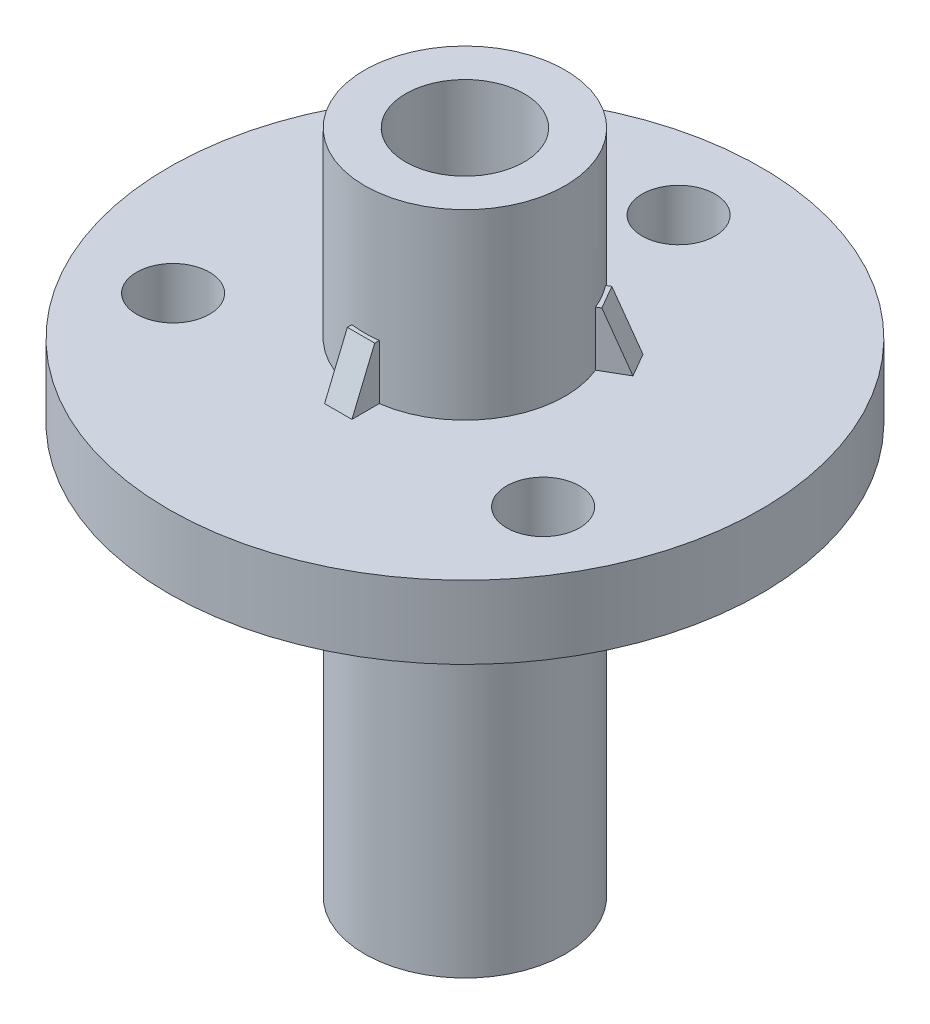
ISO-10303-21;
HEADER;
FILE_DESCRIPTION(('STEP AP214'),'2;1');
FILE_NAME('part.step','',(''),(''),'','','');
FILE_SCHEMA(('AUTOMOTIVE_DESIGN { 1 0 10303 214 1 1 1 1 }'));
ENDSEC;
DATA;
#1=APPLICATION_CONTEXT('core data for automotive mechanical design processes');
#2=APPLICATION_PROTOCOL_DEFINITION('international standard','automotive_design',2000,#1);
#3=PRODUCT_CONTEXT('',#1,'mechanical');
#4=PRODUCT('Part','Part','',(#3));
#5=PRODUCT_RELATED_PRODUCT_CATEGORY('part','',(#4));
#6=PRODUCT_DEFINITION_FORMATION('','',#4);
#7=PRODUCT_DEFINITION_CONTEXT('part definition',#1,'design');
#8=PRODUCT_DEFINITION('design','',#6,#7);
#9=PRODUCT_DEFINITION_SHAPE('','',#8);
#10=(LENGTH_UNIT() NAMED_UNIT(*) SI_UNIT(.MILLI.,.METRE.));
#11=(NAMED_UNIT(*) PLANE_ANGLE_UNIT() SI_UNIT($,.RADIAN.));
#12=(NAMED_UNIT(*) SI_UNIT($,.STERADIAN.) SOLID_ANGLE_UNIT());
#13=UNCERTAINTY_MEASURE_WITH_UNIT(LENGTH_MEASURE(1.E-05),#10,'distance_accuracy_value','');
#14=(GEOMETRIC_REPRESENTATION_CONTEXT(3) GLOBAL_UNCERTAINTY_ASSIGNED_CONTEXT((#13)) GLOBAL_UNIT_ASSIGNED_CONTEXT((#10,
#11,#12)) REPRESENTATION_CONTEXT('',''));
#15=CARTESIAN_POINT('',(0.,0.,0.));
#16=DIRECTION('',(0.,0.,1.));
#17=DIRECTION('',(1.,0.,0.));
#18=AXIS2_PLACEMENT_3D('',#15,#16,#17);
#19=CARTESIAN_POINT('',(0.,-2.032,0.));
#20=DIRECTION('',(0.,1.,0.));
#21=DIRECTION('',(0.,0.,1.));
#22=AXIS2_PLACEMENT_3D('',#19,#20,#21);
#23=PLANE('',#22);
#24=CARTESIAN_POINT('',(10.3111149638085,-2.032,5.9531249999999));
#25=DIRECTION('',(0.,1.,0.));
#26=DIRECTION('',(0.,0.,1.));
#27=AXIS2_PLACEMENT_3D('',#24,#25,#26);
#28=CIRCLE('',#27,2.032);
#29=CARTESIAN_POINT('',(10.3111149638085,-2.032,7.98512499999991));
#30=VERTEX_POINT('',#29);
#31=EDGE_CURVE('E726',#30,#30,#28,.T.);
#32=ORIENTED_EDGE('',*,*,#31,.T.);
#33=EDGE_LOOP('',(#32));
#34=FACE_BOUND('',#33,.T.);
#35=CARTESIAN_POINT('',(-10.3111149638084,-2.032,5.95312500000005));
#36=DIRECTION('',(0.,1.,0.));
#37=DIRECTION('',(0.,0.,1.));
#38=AXIS2_PLACEMENT_3D('',#35,#36,#37);
#39=CIRCLE('',#38,2.032);
#40=CARTESIAN_POINT('',(-10.3111149638084,-2.032,7.98512500000005));
#41=VERTEX_POINT('',#40);
#42=EDGE_CURVE('E730',#41,#41,#39,.T.);
#43=ORIENTED_EDGE('',*,*,#42,.T.);
#44=EDGE_LOOP('',(#43));
#45=FACE_BOUND('',#44,.T.);
#46=CARTESIAN_POINT('',(0.,-2.032,-11.90625));
#47=DIRECTION('',(0.,1.,0.));
#48=DIRECTION('',(0.,0.,1.));
#49=AXIS2_PLACEMENT_3D('',#46,#47,#48);
#50=CIRCLE('',#49,2.032);
#51=CARTESIAN_POINT('',(0.,-2.032,-9.87425));
#52=VERTEX_POINT('',#51);
#53=EDGE_CURVE('E228',#52,#52,#50,.T.);
#54=ORIENTED_EDGE('',*,*,#53,.T.);
#55=EDGE_LOOP('',(#54));
#56=FACE_BOUND('',#55,.T.);
#57=CARTESIAN_POINT('',(0.,-2.032,0.));
#58=DIRECTION('',(0.,1.,0.));
#59=DIRECTION('',(0.,0.,1.));
#60=AXIS2_PLACEMENT_3D('',#57,#58,#59);
#61=CIRCLE('',#60,16.51);
#62=CARTESIAN_POINT('',(0.,-2.032,16.51));
#63=VERTEX_POINT('',#62);
#64=EDGE_CURVE('E314',#63,#63,#61,.T.);
#65=ORIENTED_EDGE('',*,*,#64,.F.);
#66=EDGE_LOOP('',(#65));
#67=FACE_BOUND('',#66,.T.);
#68=DIRECTION('',(0.866025403784443,0.,-0.499999999999993));
#69=VECTOR('',#68,1.);
#70=CARTESIAN_POINT('',(-0.380999999999991,-2.032,-0.659911357683739));
#71=LINE('',#70,#69);
#72=CARTESIAN_POINT('',(4.41314486639696,-2.032,-3.42781218683203));
#73=VERTEX_POINT('',#72);
#74=CARTESIAN_POINT('',(5.73296758176445,-2.032,-4.18981218683202));
#75=VERTEX_POINT('',#74);
#76=EDGE_CURVE('E239',#73,#75,#71,.T.);
#77=ORIENTED_EDGE('',*,*,#76,.F.);
#78=CARTESIAN_POINT('',(0.,-2.032,0.));
#79=DIRECTION('',(0.,1.,0.));
#80=DIRECTION('',(0.,0.,1.));
#81=AXIS2_PLACEMENT_3D('',#78,#79,#80);
#82=CIRCLE('',#81,5.588);
#83=CARTESIAN_POINT('',(-4.41314486639691,-2.032,-3.42781218683209));
#84=VERTEX_POINT('',#83);
#85=EDGE_CURVE('E327',#84,#73,#82,.F.);
#86=ORIENTED_EDGE('',*,*,#85,.F.);
#87=DIRECTION('',(0.866025403784437,0.,0.500000000000003));
#88=VECTOR('',#87,1.);
#89=CARTESIAN_POINT('',(0.381000000000006,-2.032,-0.659911357683747));
#90=LINE('',#89,#88);
#91=CARTESIAN_POINT('',(-5.73296758176439,-2.032,-4.1898121868321));
#92=VERTEX_POINT('',#91);
#93=EDGE_CURVE('E263',#92,#84,#90,.T.);
#94=ORIENTED_EDGE('',*,*,#93,.F.);
#95=DIRECTION('',(0.500000000000004,0.,-0.866025403784436));
#96=VECTOR('',#95,1.);
#97=CARTESIAN_POINT('',(-6.1139675817644,-2.032,-3.52990082914836));
#98=LINE('',#97,#96);
#99=CARTESIAN_POINT('',(-6.4949675817644,-2.032,-2.86998947146462));
#100=VERTEX_POINT('',#99);
#101=EDGE_CURVE('E271',#100,#92,#98,.T.);
#102=ORIENTED_EDGE('',*,*,#101,.F.);
#103=DIRECTION('',(-0.866025403784437,0.,-0.500000000000003));
#104=VECTOR('',#103,1.);
#105=CARTESIAN_POINT('',(-0.380999999999999,-2.032,0.659911357683735));
#106=LINE('',#105,#104);
#107=CARTESIAN_POINT('',(-5.17514486639692,-2.032,-2.10798947146461));
#108=VERTEX_POINT('',#107);
#109=EDGE_CURVE('E268',#108,#100,#106,.T.);
#110=ORIENTED_EDGE('',*,*,#109,.F.);
#111=CARTESIAN_POINT('',(-0.762000000000001,-2.032,5.53580165829666));
#112=VERTEX_POINT('',#111);
#113=EDGE_CURVE('E323',#112,#108,#82,.F.);
#114=ORIENTED_EDGE('',*,*,#113,.F.);
#115=DIRECTION('',(0.,0.,-1.));
#116=VECTOR('',#115,1.);
#117=CARTESIAN_POINT('',(-0.762000000000007,-2.032,0.));
#118=LINE('',#117,#116);
#119=CARTESIAN_POINT('',(-0.761999999999999,-2.032,7.05980165829666));
#120=VERTEX_POINT('',#119);
#121=EDGE_CURVE('E291',#120,#112,#118,.T.);
#122=ORIENTED_EDGE('',*,*,#121,.F.);
#123=DIRECTION('',(-1.,0.,0.));
#124=VECTOR('',#123,1.);
#125=CARTESIAN_POINT('',(0.,-2.032,7.05980165829666));
#126=LINE('',#125,#124);
#127=CARTESIAN_POINT('',(0.762000000000001,-2.032,7.05980165829666));
#128=VERTEX_POINT('',#127);
#129=EDGE_CURVE('E298',#128,#120,#126,.T.);
#130=ORIENTED_EDGE('',*,*,#129,.F.);
#131=DIRECTION('',(0.,0.,1.));
#132=VECTOR('',#131,1.);
#133=CARTESIAN_POINT('',(0.761999999999993,-2.032,0.));
#134=LINE('',#133,#132);
#135=CARTESIAN_POINT('',(0.761999999999999,-2.032,5.53580165829666));
#136=VERTEX_POINT('',#135);
#137=EDGE_CURVE('E296',#136,#128,#134,.T.);
#138=ORIENTED_EDGE('',*,*,#137,.F.);
#139=CARTESIAN_POINT('',(5.17514486639695,-2.032,-2.10798947146454));
#140=VERTEX_POINT('',#139);
#141=EDGE_CURVE('E320',#140,#136,#82,.F.);
#142=ORIENTED_EDGE('',*,*,#141,.F.);
#143=DIRECTION('',(-0.866025403784443,0.,0.499999999999993));
#144=VECTOR('',#143,1.);
#145=CARTESIAN_POINT('',(0.380999999999998,-2.032,0.659911357683751));
#146=LINE('',#145,#144);
#147=CARTESIAN_POINT('',(6.49496758176444,-2.032,-2.86998947146453));
#148=VERTEX_POINT('',#147);
#149=EDGE_CURVE('E234',#148,#140,#146,.T.);
#150=ORIENTED_EDGE('',*,*,#149,.F.);
#151=DIRECTION('',(0.499999999999992,0.,0.866025403784443));
#152=VECTOR('',#151,1.);
#153=CARTESIAN_POINT('',(6.11396758176444,-2.032,-3.52990082914827));
#154=LINE('',#153,#152);
#155=EDGE_CURVE('E242',#75,#148,#154,.T.);
#156=ORIENTED_EDGE('',*,*,#155,.F.);
#157=EDGE_LOOP('',(#77,#86,#94,#102,#110,#114,#122,#130,#138,#142,#150,#156));
#158=FACE_BOUND('',#157,.T.);
#159=ADVANCED_FACE('F35',(#34,#45,#56,#67,#158),#23,.F.);
#160=CARTESIAN_POINT('',(0.,2.032,0.));
#161=DIRECTION('',(0.,1.,0.));
#162=DIRECTION('',(0.,0.,1.));
#163=AXIS2_PLACEMENT_3D('',#160,#161,#162);
#164=PLANE('',#163);
#165=CARTESIAN_POINT('',(10.3111149638085,2.032,5.9531249999999));
#166=DIRECTION('',(0.,1.,0.));
#167=DIRECTION('',(-0.866025403784443,0.,-0.499999999999992));
#168=AXIS2_PLACEMENT_3D('',#165,#166,#167);
#169=CIRCLE('',#168,2.032);
#170=CARTESIAN_POINT('',(8.55135134331854,2.032,4.93712499999992));
#171=VERTEX_POINT('',#170);
#172=EDGE_CURVE('E724',#171,#171,#169,.T.);
#173=ORIENTED_EDGE('',*,*,#172,.F.);
#174=EDGE_LOOP('',(#173));
#175=FACE_BOUND('',#174,.T.);
#176=CARTESIAN_POINT('',(-10.3111149638084,2.032,5.95312500000005));
#177=DIRECTION('',(0.,1.,0.));
#178=DIRECTION('',(0.866025403784436,0.,-0.500000000000004));
#179=AXIS2_PLACEMENT_3D('',#176,#177,#178);
#180=CIRCLE('',#179,2.032);
#181=CARTESIAN_POINT('',(-8.55135134331847,2.032,4.93712500000004));
#182=VERTEX_POINT('',#181);
#183=EDGE_CURVE('E727',#182,#182,#180,.T.);
#184=ORIENTED_EDGE('',*,*,#183,.F.);
#185=EDGE_LOOP('',(#184));
#186=FACE_BOUND('',#185,.T.);
#187=CARTESIAN_POINT('',(0.,2.032,-11.90625));
#188=DIRECTION('',(0.,1.,0.));
#189=DIRECTION('',(0.,0.,1.));
#190=AXIS2_PLACEMENT_3D('',#187,#188,#189);
#191=CIRCLE('',#190,2.032);
#192=CARTESIAN_POINT('',(0.,2.032,-9.87425));
#193=VERTEX_POINT('',#192);
#194=EDGE_CURVE('E736',#193,#193,#191,.T.);
#195=ORIENTED_EDGE('',*,*,#194,.F.);
#196=EDGE_LOOP('',(#195));
#197=FACE_BOUND('',#196,.T.);
#198=CARTESIAN_POINT('',(0.,2.032,0.));
#199=DIRECTION('',(0.,1.,0.));
#200=DIRECTION('',(0.,0.,1.));
#201=AXIS2_PLACEMENT_3D('',#198,#199,#200);
#202=CIRCLE('',#201,16.51);
#203=CARTESIAN_POINT('',(0.,2.032,16.51));
#204=VERTEX_POINT('',#203);
#205=EDGE_CURVE('E317',#204,#204,#202,.T.);
#206=ORIENTED_EDGE('',*,*,#205,.T.);
#207=EDGE_LOOP('',(#206));
#208=FACE_BOUND('',#207,.T.);
#209=CARTESIAN_POINT('',(0.,2.032,0.));
#210=DIRECTION('',(0.,1.,0.));
#211=DIRECTION('',(0.,0.,1.));
#212=AXIS2_PLACEMENT_3D('',#209,#210,#211);
#213=CIRCLE('',#212,5.588);
#214=CARTESIAN_POINT('',(4.41314486639695,2.032,-3.42781218683204));
#215=VERTEX_POINT('',#214);
#216=CARTESIAN_POINT('',(-4.41314486639691,2.032,-3.42781218683209));
#217=VERTEX_POINT('',#216);
#218=EDGE_CURVE('E316',#215,#217,#213,.T.);
#219=ORIENTED_EDGE('',*,*,#218,.F.);
#220=DIRECTION('',(0.866025403784443,0.,-0.499999999999993));
#221=VECTOR('',#220,1.);
#222=CARTESIAN_POINT('',(-0.380999999999991,2.032,-0.659911357683739));
#223=LINE('',#222,#221);
#224=CARTESIAN_POINT('',(5.73296758176445,2.032,-4.18981218683202));
#225=VERTEX_POINT('',#224);
#226=EDGE_CURVE('E236',#215,#225,#223,.T.);
#227=ORIENTED_EDGE('',*,*,#226,.T.);
#228=DIRECTION('',(0.499999999999992,0.,0.866025403784443));
#229=VECTOR('',#228,1.);
#230=CARTESIAN_POINT('',(6.11396758176444,2.032,-3.52990082914827));
#231=LINE('',#230,#229);
#232=CARTESIAN_POINT('',(6.49496758176444,2.032,-2.86998947146453));
#233=VERTEX_POINT('',#232);
#234=EDGE_CURVE('E215',#225,#233,#231,.T.);
#235=ORIENTED_EDGE('',*,*,#234,.T.);
#236=DIRECTION('',(-0.866025403784443,0.,0.499999999999993));
#237=VECTOR('',#236,1.);
#238=CARTESIAN_POINT('',(0.380999999999998,2.032,0.659911357683751));
#239=LINE('',#238,#237);
#240=CARTESIAN_POINT('',(5.17514486639695,2.032,-2.10798947146454));
#241=VERTEX_POINT('',#240);
#242=EDGE_CURVE('E232',#233,#241,#239,.T.);
#243=ORIENTED_EDGE('',*,*,#242,.T.);
#244=CARTESIAN_POINT('',(0.762,2.032,5.53580165829666));
#245=VERTEX_POINT('',#244);
#246=EDGE_CURVE('E201',#245,#241,#213,.T.);
#247=ORIENTED_EDGE('',*,*,#246,.F.);
#248=DIRECTION('',(0.,0.,1.));
#249=VECTOR('',#248,1.);
#250=CARTESIAN_POINT('',(0.761999999999993,2.032,0.));
#251=LINE('',#250,#249);
#252=CARTESIAN_POINT('',(0.762000000000001,2.032,7.05980165829666));
#253=VERTEX_POINT('',#252);
#254=EDGE_CURVE('E293',#245,#253,#251,.T.);
#255=ORIENTED_EDGE('',*,*,#254,.T.);
#256=DIRECTION('',(-1.,0.,0.));
#257=VECTOR('',#256,1.);
#258=CARTESIAN_POINT('',(0.,2.032,7.05980165829666));
#259=LINE('',#258,#257);
#260=CARTESIAN_POINT('',(-0.761999999999999,2.032,7.05980165829666));
#261=VERTEX_POINT('',#260);
#262=EDGE_CURVE('E339',#253,#261,#259,.T.);
#263=ORIENTED_EDGE('',*,*,#262,.T.);
#264=DIRECTION('',(0.,0.,-1.));
#265=VECTOR('',#264,1.);
#266=CARTESIAN_POINT('',(-0.762000000000007,2.032,0.));
#267=LINE('',#266,#265);
#268=CARTESIAN_POINT('',(-0.762000000000001,2.032,5.53580165829666));
#269=VERTEX_POINT('',#268);
#270=EDGE_CURVE('E288',#261,#269,#267,.T.);
#271=ORIENTED_EDGE('',*,*,#270,.T.);
#272=CARTESIAN_POINT('',(-5.17514486639692,2.032,-2.10798947146461));
#273=VERTEX_POINT('',#272);
#274=EDGE_CURVE('E310',#273,#269,#213,.T.);
#275=ORIENTED_EDGE('',*,*,#274,.F.);
#276=DIRECTION('',(-0.866025403784437,0.,-0.500000000000003));
#277=VECTOR('',#276,1.);
#278=CARTESIAN_POINT('',(-0.380999999999999,2.032,0.659911357683735));
#279=LINE('',#278,#277);
#280=CARTESIAN_POINT('',(-6.4949675817644,2.032,-2.86998947146462));
#281=VERTEX_POINT('',#280);
#282=EDGE_CURVE('E265',#273,#281,#279,.T.);
#283=ORIENTED_EDGE('',*,*,#282,.T.);
#284=DIRECTION('',(0.500000000000004,0.,-0.866025403784436));
#285=VECTOR('',#284,1.);
#286=CARTESIAN_POINT('',(-6.1139675817644,2.032,-3.52990082914836));
#287=LINE('',#286,#285);
#288=CARTESIAN_POINT('',(-5.73296758176439,2.032,-4.1898121868321));
#289=VERTEX_POINT('',#288);
#290=EDGE_CURVE('E352',#281,#289,#287,.T.);
#291=ORIENTED_EDGE('',*,*,#290,.T.);
#292=DIRECTION('',(0.866025403784437,0.,0.500000000000003));
#293=VECTOR('',#292,1.);
#294=CARTESIAN_POINT('',(0.381000000000006,2.032,-0.659911357683747));
#295=LINE('',#294,#293);
#296=EDGE_CURVE('E260',#289,#217,#295,.T.);
#297=ORIENTED_EDGE('',*,*,#296,.T.);
#298=EDGE_LOOP('',(#219,#227,#235,#243,#247,#255,#263,#271,#275,#283,#291,#297));
#299=FACE_BOUND('',#298,.T.);
#300=ADVANCED_FACE('F447',(#175,#186,#197,#208,#299),#164,.T.);
#301=CARTESIAN_POINT('',(0.,12.192,0.));
#302=DIRECTION('',(0.,-1.,0.));
#303=DIRECTION('',(0.,0.,-1.));
#304=AXIS2_PLACEMENT_3D('',#301,#302,#303);
#305=CYLINDRICAL_SURFACE('',#304,5.588);
#306=CARTESIAN_POINT('',(0.,12.192,0.));
#307=DIRECTION('',(0.,1.,0.));
#308=DIRECTION('',(0.,0.,1.));
#309=AXIS2_PLACEMENT_3D('',#306,#307,#308);
#310=CIRCLE('',#309,5.588);
#311=CARTESIAN_POINT('',(0.,12.192,5.588));
#312=VERTEX_POINT('',#311);
#313=EDGE_CURVE('E311',#312,#312,#310,.T.);
#314=ORIENTED_EDGE('',*,*,#313,.F.);
#315=EDGE_LOOP('',(#314));
#316=FACE_BOUND('',#315,.T.);
#317=DIRECTION('',(0.,-1.,0.));
#318=VECTOR('',#317,1.);
#319=CARTESIAN_POINT('',(4.41314486639696,5.08,-3.42781218683203));
#320=LINE('',#319,#318);
#321=CARTESIAN_POINT('',(4.41314486639695,5.08,-3.42781218683204));
#322=VERTEX_POINT('',#321);
#323=EDGE_CURVE('E205',#322,#215,#320,.T.);
#324=ORIENTED_EDGE('',*,*,#323,.T.);
#325=ORIENTED_EDGE('',*,*,#218,.T.);
#326=DIRECTION('',(0.,-1.,0.));
#327=VECTOR('',#326,1.);
#328=CARTESIAN_POINT('',(-4.41314486639691,5.08,-3.42781218683209));
#329=LINE('',#328,#327);
#330=CARTESIAN_POINT('',(-4.41314486639691,5.08,-3.42781218683209));
#331=VERTEX_POINT('',#330);
#332=EDGE_CURVE('E252',#331,#217,#329,.T.);
#333=ORIENTED_EDGE('',*,*,#332,.F.);
#334=CARTESIAN_POINT('',(0.,5.08,0.));
#335=DIRECTION('',(0.,-1.,0.));
#336=DIRECTION('',(0.,0.,-1.));
#337=AXIS2_PLACEMENT_3D('',#334,#335,#336);
#338=CIRCLE('',#337,5.588);
#339=CARTESIAN_POINT('',(-5.17514486639691,5.08,-2.10798947146462));
#340=VERTEX_POINT('',#339);
#341=EDGE_CURVE('E349',#340,#331,#338,.T.);
#342=ORIENTED_EDGE('',*,*,#341,.F.);
#343=DIRECTION('',(0.,-1.,0.));
#344=VECTOR('',#343,1.);
#345=CARTESIAN_POINT('',(-5.17514486639692,5.08,-2.10798947146461));
#346=LINE('',#345,#344);
#347=EDGE_CURVE('E258',#340,#273,#346,.T.);
#348=ORIENTED_EDGE('',*,*,#347,.T.);
#349=ORIENTED_EDGE('',*,*,#274,.T.);
#350=DIRECTION('',(0.,-1.,0.));
#351=VECTOR('',#350,1.);
#352=CARTESIAN_POINT('',(-0.762000000000001,5.08,5.53580165829666));
#353=LINE('',#352,#351);
#354=CARTESIAN_POINT('',(-0.762000000000001,5.08,5.53580165829666));
#355=VERTEX_POINT('',#354);
#356=EDGE_CURVE('E281',#355,#269,#353,.T.);
#357=ORIENTED_EDGE('',*,*,#356,.F.);
#358=CARTESIAN_POINT('',(0.,5.08,0.));
#359=DIRECTION('',(0.,-1.,0.));
#360=DIRECTION('',(0.,0.,-1.));
#361=AXIS2_PLACEMENT_3D('',#358,#359,#360);
#362=CIRCLE('',#361,5.588);
#363=CARTESIAN_POINT('',(0.762000000000004,5.08,5.53580165829665));
#364=VERTEX_POINT('',#363);
#365=EDGE_CURVE('E336',#364,#355,#362,.T.);
#366=ORIENTED_EDGE('',*,*,#365,.F.);
#367=DIRECTION('',(0.,-1.,0.));
#368=VECTOR('',#367,1.);
#369=CARTESIAN_POINT('',(0.761999999999999,5.08,5.53580165829666));
#370=LINE('',#369,#368);
#371=EDGE_CURVE('E286',#364,#245,#370,.T.);
#372=ORIENTED_EDGE('',*,*,#371,.T.);
#373=ORIENTED_EDGE('',*,*,#246,.T.);
#374=DIRECTION('',(0.,-1.,0.));
#375=VECTOR('',#374,1.);
#376=CARTESIAN_POINT('',(5.17514486639695,5.08,-2.10798947146454));
#377=LINE('',#376,#375);
#378=CARTESIAN_POINT('',(5.17514486639695,5.08,-2.10798947146454));
#379=VERTEX_POINT('',#378);
#380=EDGE_CURVE('E195',#379,#241,#377,.T.);
#381=ORIENTED_EDGE('',*,*,#380,.F.);
#382=CARTESIAN_POINT('',(0.,5.08,0.));
#383=DIRECTION('',(0.,-1.,0.));
#384=DIRECTION('',(0.,0.,-1.));
#385=AXIS2_PLACEMENT_3D('',#382,#383,#384);
#386=CIRCLE('',#385,5.588);
#387=EDGE_CURVE('E198',#322,#379,#386,.T.);
#388=ORIENTED_EDGE('',*,*,#387,.F.);
#389=EDGE_LOOP('',(#324,#325,#333,#342,#348,#349,#357,#366,#372,#373,#381,#388));
#390=FACE_BOUND('',#389,.T.);
#391=ADVANCED_FACE('F197',(#316,#390),#305,.T.);
#392=CARTESIAN_POINT('',(0.,-24.892,0.));
#393=DIRECTION('',(0.,1.,0.));
#394=DIRECTION('',(0.,0.,1.));
#395=AXIS2_PLACEMENT_3D('',#392,#393,#394);
#396=CYLINDRICAL_SURFACE('',#395,5.588);
#397=CARTESIAN_POINT('',(0.,-24.892,0.));
#398=DIRECTION('',(0.,-1.,0.));
#399=DIRECTION('',(0.,0.,-1.));
#400=AXIS2_PLACEMENT_3D('',#397,#398,#399);
#401=CIRCLE('',#400,5.588);
#402=CARTESIAN_POINT('',(0.,-24.892,-5.588));
#403=VERTEX_POINT('',#402);
#404=EDGE_CURVE('E305',#403,#403,#401,.T.);
#405=ORIENTED_EDGE('',*,*,#404,.F.);
#406=EDGE_LOOP('',(#405));
#407=FACE_BOUND('',#406,.T.);
#408=DIRECTION('',(0.,1.,0.));
#409=VECTOR('',#408,1.);
#410=CARTESIAN_POINT('',(4.41314486639695,-24.892,-3.42781218683204));
#411=LINE('',#410,#409);
#412=CARTESIAN_POINT('',(4.41314486639696,-5.08,-3.42781218683203));
#413=VERTEX_POINT('',#412);
#414=EDGE_CURVE('E216',#413,#73,#411,.T.);
#415=ORIENTED_EDGE('',*,*,#414,.F.);
#416=CARTESIAN_POINT('',(0.,-5.08,0.));
#417=DIRECTION('',(0.,-1.,0.));
#418=DIRECTION('',(0.,0.,-1.));
#419=AXIS2_PLACEMENT_3D('',#416,#417,#418);
#420=CIRCLE('',#419,5.588);
#421=CARTESIAN_POINT('',(5.17514486639695,-5.08,-2.10798947146454));
#422=VERTEX_POINT('',#421);
#423=EDGE_CURVE('E354',#413,#422,#420,.T.);
#424=ORIENTED_EDGE('',*,*,#423,.T.);
#425=DIRECTION('',(0.,1.,0.));
#426=VECTOR('',#425,1.);
#427=CARTESIAN_POINT('',(5.17514486639694,-24.892,-2.10798947146454));
#428=LINE('',#427,#426);
#429=EDGE_CURVE('E357',#140,#422,#428,.F.);
#430=ORIENTED_EDGE('',*,*,#429,.F.);
#431=ORIENTED_EDGE('',*,*,#141,.T.);
#432=DIRECTION('',(0.,1.,0.));
#433=VECTOR('',#432,1.);
#434=CARTESIAN_POINT('',(0.762,-24.892,5.53580165829666));
#435=LINE('',#434,#433);
#436=CARTESIAN_POINT('',(0.761999999999999,-5.08,5.53580165829666));
#437=VERTEX_POINT('',#436);
#438=EDGE_CURVE('E333',#437,#136,#435,.T.);
#439=ORIENTED_EDGE('',*,*,#438,.F.);
#440=CARTESIAN_POINT('',(0.,-5.08,0.));
#441=DIRECTION('',(0.,-1.,0.));
#442=DIRECTION('',(0.,0.,-1.));
#443=AXIS2_PLACEMENT_3D('',#440,#441,#442);
#444=CIRCLE('',#443,5.588);
#445=CARTESIAN_POINT('',(-0.762000000000001,-5.08,5.53580165829666));
#446=VERTEX_POINT('',#445);
#447=EDGE_CURVE('E326',#437,#446,#444,.T.);
#448=ORIENTED_EDGE('',*,*,#447,.T.);
#449=DIRECTION('',(0.,1.,0.));
#450=VECTOR('',#449,1.);
#451=CARTESIAN_POINT('',(-0.762000000000001,-24.892,5.53580165829665));
#452=LINE('',#451,#450);
#453=EDGE_CURVE('E330',#112,#446,#452,.F.);
#454=ORIENTED_EDGE('',*,*,#453,.F.);
#455=ORIENTED_EDGE('',*,*,#113,.T.);
#456=DIRECTION('',(0.,1.,0.));
#457=VECTOR('',#456,1.);
#458=CARTESIAN_POINT('',(-5.17514486639692,-24.892,-2.10798947146461));
#459=LINE('',#458,#457);
#460=CARTESIAN_POINT('',(-5.17514486639692,-5.08,-2.10798947146461));
#461=VERTEX_POINT('',#460);
#462=EDGE_CURVE('E347',#461,#108,#459,.T.);
#463=ORIENTED_EDGE('',*,*,#462,.F.);
#464=CARTESIAN_POINT('',(0.,-5.08,0.));
#465=DIRECTION('',(0.,-1.,0.));
#466=DIRECTION('',(0.,0.,-1.));
#467=AXIS2_PLACEMENT_3D('',#464,#465,#466);
#468=CIRCLE('',#467,5.588);
#469=CARTESIAN_POINT('',(-4.41314486639691,-5.08,-3.42781218683209));
#470=VERTEX_POINT('',#469);
#471=EDGE_CURVE('E341',#461,#470,#468,.T.);
#472=ORIENTED_EDGE('',*,*,#471,.T.);
#473=DIRECTION('',(0.,1.,0.));
#474=VECTOR('',#473,1.);
#475=CARTESIAN_POINT('',(-4.41314486639691,-24.892,-3.42781218683209));
#476=LINE('',#475,#474);
#477=EDGE_CURVE('E344',#84,#470,#476,.F.);
#478=ORIENTED_EDGE('',*,*,#477,.F.);
#479=ORIENTED_EDGE('',*,*,#85,.T.);
#480=EDGE_LOOP('',(#415,#424,#430,#431,#439,#448,#454,#455,#463,#472,#478,#479));
#481=FACE_BOUND('',#480,.T.);
#482=ADVANCED_FACE('F416',(#407,#481),#396,.T.);
#483=CARTESIAN_POINT('',(0.,2.032,0.));
#484=DIRECTION('',(0.,-1.,0.));
#485=DIRECTION('',(0.,0.,-1.));
#486=AXIS2_PLACEMENT_3D('',#483,#484,#485);
#487=CYLINDRICAL_SURFACE('',#486,16.51);
#488=ORIENTED_EDGE('',*,*,#205,.F.);
#489=EDGE_LOOP('',(#488));
#490=FACE_BOUND('',#489,.T.);
#491=ORIENTED_EDGE('',*,*,#64,.T.);
#492=EDGE_LOOP('',(#491));
#493=FACE_BOUND('',#492,.T.);
#494=ADVANCED_FACE('F459',(#490,#493),#487,.T.);
#495=CARTESIAN_POINT('',(0.,12.192,0.));
#496=DIRECTION('',(0.,1.,0.));
#497=DIRECTION('',(0.,0.,1.));
#498=AXIS2_PLACEMENT_3D('',#495,#496,#497);
#499=PLANE('',#498);
#500=CARTESIAN_POINT('',(0.,12.192,0.));
#501=DIRECTION('',(0.,1.,0.));
#502=DIRECTION('',(0.,0.,1.));
#503=AXIS2_PLACEMENT_3D('',#500,#501,#502);
#504=CIRCLE('',#503,3.302);
#505=CARTESIAN_POINT('',(0.,12.192,3.302));
#506=VERTEX_POINT('',#505);
#507=EDGE_CURVE('E301',#506,#506,#504,.T.);
#508=ORIENTED_EDGE('',*,*,#507,.F.);
#509=EDGE_LOOP('',(#508));
#510=FACE_BOUND('',#509,.T.);
#511=ORIENTED_EDGE('',*,*,#313,.T.);
#512=EDGE_LOOP('',(#511));
#513=FACE_BOUND('',#512,.T.);
#514=ADVANCED_FACE('F462',(#510,#513),#499,.T.);
#515=CARTESIAN_POINT('',(0.,-24.892,0.));
#516=DIRECTION('',(0.,-1.,0.));
#517=DIRECTION('',(0.,0.,-1.));
#518=AXIS2_PLACEMENT_3D('',#515,#516,#517);
#519=PLANE('',#518);
#520=CARTESIAN_POINT('',(0.,-24.892,0.));
#521=DIRECTION('',(0.,1.,0.));
#522=DIRECTION('',(0.,0.,1.));
#523=AXIS2_PLACEMENT_3D('',#520,#521,#522);
#524=CIRCLE('',#523,3.302);
#525=CARTESIAN_POINT('',(0.,-24.892,3.302));
#526=VERTEX_POINT('',#525);
#527=EDGE_CURVE('E302',#526,#526,#524,.T.);
#528=ORIENTED_EDGE('',*,*,#527,.T.);
#529=EDGE_LOOP('',(#528));
#530=FACE_BOUND('',#529,.T.);
#531=ORIENTED_EDGE('',*,*,#404,.T.);
#532=EDGE_LOOP('',(#531));
#533=FACE_BOUND('',#532,.T.);
#534=ADVANCED_FACE('F555',(#530,#533),#519,.T.);
#535=CARTESIAN_POINT('',(0.,-24.892,0.));
#536=DIRECTION('',(0.,1.,0.));
#537=DIRECTION('',(0.,0.,1.));
#538=AXIS2_PLACEMENT_3D('',#535,#536,#537);
#539=CYLINDRICAL_SURFACE('',#538,3.302);
#540=ORIENTED_EDGE('',*,*,#527,.F.);
#541=EDGE_LOOP('',(#540));
#542=FACE_BOUND('',#541,.T.);
#543=ORIENTED_EDGE('',*,*,#507,.T.);
#544=EDGE_LOOP('',(#543));
#545=FACE_BOUND('',#544,.T.);
#546=ADVANCED_FACE('F548',(#542,#545),#539,.F.);
#547=CARTESIAN_POINT('',(0.761999999999999,-5.08,5.53580165829666));
#548=DIRECTION('',(0.,-1.,0.));
#549=DIRECTION('',(0.,0.,-1.));
#550=AXIS2_PLACEMENT_3D('',#547,#548,#549);
#551=PLANE('',#550);
#552=DIRECTION('',(0.,0.,-1.));
#553=VECTOR('',#552,1.);
#554=CARTESIAN_POINT('',(0.762000000000001,-5.08,7.05980165829666));
#555=LINE('',#554,#553);
#556=CARTESIAN_POINT('',(0.761999999999999,-5.08,5.78980165829665));
#557=VERTEX_POINT('',#556);
#558=EDGE_CURVE('E274',#557,#437,#555,.T.);
#559=ORIENTED_EDGE('',*,*,#558,.F.);
#560=DIRECTION('',(-1.,0.,0.));
#561=VECTOR('',#560,1.);
#562=CARTESIAN_POINT('',(-0.761999999999999,-5.08,5.78980165829665));
#563=LINE('',#562,#561);
#564=CARTESIAN_POINT('',(-0.762000000000001,-5.08,5.78980165829665));
#565=VERTEX_POINT('',#564);
#566=EDGE_CURVE('E43',#557,#565,#563,.T.);
#567=ORIENTED_EDGE('',*,*,#566,.T.);
#568=DIRECTION('',(0.,0.,1.));
#569=VECTOR('',#568,1.);
#570=CARTESIAN_POINT('',(-0.761999999999999,-5.08,7.05980165829666));
#571=LINE('',#570,#569);
#572=EDGE_CURVE('E278',#446,#565,#571,.T.);
#573=ORIENTED_EDGE('',*,*,#572,.F.);
#574=ORIENTED_EDGE('',*,*,#447,.F.);
#575=EDGE_LOOP('',(#559,#567,#573,#574));
#576=FACE_BOUND('',#575,.T.);
#577=ADVANCED_FACE('F546',(#576),#551,.T.);
#578=CARTESIAN_POINT('',(-0.761999999999999,5.08,7.05980165829666));
#579=DIRECTION('',(1.,0.,0.));
#580=DIRECTION('',(0.,0.,-1.));
#581=AXIS2_PLACEMENT_3D('',#578,#579,#580);
#582=PLANE('',#581);
#583=ORIENTED_EDGE('',*,*,#572,.T.);
#584=DIRECTION('',(0.,0.923076923076924,0.384615384615382));
#585=VECTOR('',#584,1.);
#586=CARTESIAN_POINT('',(-0.761999999999999,-2.03199999999997,7.05980165829666));
#587=LINE('',#586,#585);
#588=EDGE_CURVE('E11',#565,#120,#587,.T.);
#589=ORIENTED_EDGE('',*,*,#588,.T.);
#590=ORIENTED_EDGE('',*,*,#121,.T.);
#591=ORIENTED_EDGE('',*,*,#453,.T.);
#592=EDGE_LOOP('',(#583,#589,#590,#591));
#593=FACE_BOUND('',#592,.T.);
#594=ADVANCED_FACE('F420',(#593),#582,.F.);
#595=CARTESIAN_POINT('',(0.762000000000001,5.08,7.05980165829666));
#596=DIRECTION('',(-1.,0.,0.));
#597=DIRECTION('',(0.,0.,1.));
#598=AXIS2_PLACEMENT_3D('',#595,#596,#597);
#599=PLANE('',#598);
#600=ORIENTED_EDGE('',*,*,#137,.T.);
#601=DIRECTION('',(0.,-0.923076923076924,-0.384615384615382));
#602=VECTOR('',#601,1.);
#603=CARTESIAN_POINT('',(0.762000000000001,-2.03199999999997,7.05980165829666));
#604=LINE('',#603,#602);
#605=EDGE_CURVE('E57',#128,#557,#604,.T.);
#606=ORIENTED_EDGE('',*,*,#605,.T.);
#607=ORIENTED_EDGE('',*,*,#558,.T.);
#608=ORIENTED_EDGE('',*,*,#438,.T.);
#609=EDGE_LOOP('',(#600,#606,#607,#608));
#610=FACE_BOUND('',#609,.T.);
#611=ADVANCED_FACE('F425',(#610),#599,.F.);
#612=CARTESIAN_POINT('',(0.761999999999999,5.08,5.53580165829666));
#613=DIRECTION('',(0.,-1.,0.));
#614=DIRECTION('',(0.,0.,-1.));
#615=AXIS2_PLACEMENT_3D('',#612,#613,#614);
#616=PLANE('',#615);
#617=DIRECTION('',(0.,0.,1.));
#618=VECTOR('',#617,1.);
#619=CARTESIAN_POINT('',(-0.761999999999999,5.08,7.05980165829666));
#620=LINE('',#619,#618);
#621=CARTESIAN_POINT('',(-0.762000000000001,5.08,5.78980165829666));
#622=VERTEX_POINT('',#621);
#623=EDGE_CURVE('E277',#355,#622,#620,.T.);
#624=ORIENTED_EDGE('',*,*,#623,.T.);
#625=DIRECTION('',(1.,0.,0.));
#626=VECTOR('',#625,1.);
#627=CARTESIAN_POINT('',(0.761999999999999,5.08,5.78980165829666));
#628=LINE('',#627,#626);
#629=CARTESIAN_POINT('',(0.761999999999999,5.08,5.78980165829666));
#630=VERTEX_POINT('',#629);
#631=EDGE_CURVE('E374',#622,#630,#628,.T.);
#632=ORIENTED_EDGE('',*,*,#631,.T.);
#633=DIRECTION('',(0.,0.,-1.));
#634=VECTOR('',#633,1.);
#635=CARTESIAN_POINT('',(0.762000000000001,5.08,7.05980165829666));
#636=LINE('',#635,#634);
#637=EDGE_CURVE('E275',#630,#364,#636,.T.);
#638=ORIENTED_EDGE('',*,*,#637,.T.);
#639=ORIENTED_EDGE('',*,*,#365,.T.);
#640=EDGE_LOOP('',(#624,#632,#638,#639));
#641=FACE_BOUND('',#640,.T.);
#642=ADVANCED_FACE('F542',(#641),#616,.F.);
#643=ORIENTED_EDGE('',*,*,#637,.F.);
#644=DIRECTION('',(0.,0.923076923076924,-0.384615384615382));
#645=VECTOR('',#644,1.);
#646=CARTESIAN_POINT('',(0.761999999999999,5.08,5.78980165829666));
#647=LINE('',#646,#645);
#648=EDGE_CURVE('E377',#630,#253,#647,.F.);
#649=ORIENTED_EDGE('',*,*,#648,.T.);
#650=ORIENTED_EDGE('',*,*,#254,.F.);
#651=ORIENTED_EDGE('',*,*,#371,.F.);
#652=EDGE_LOOP('',(#643,#649,#650,#651));
#653=FACE_BOUND('',#652,.T.);
#654=ADVANCED_FACE('F442',(#653),#599,.F.);
#655=ORIENTED_EDGE('',*,*,#270,.F.);
#656=DIRECTION('',(0.,-0.923076923076924,0.384615384615382));
#657=VECTOR('',#656,1.);
#658=CARTESIAN_POINT('',(-0.762000000000001,5.08,5.78980165829666));
#659=LINE('',#658,#657);
#660=EDGE_CURVE('E379',#261,#622,#659,.F.);
#661=ORIENTED_EDGE('',*,*,#660,.T.);
#662=ORIENTED_EDGE('',*,*,#623,.F.);
#663=ORIENTED_EDGE('',*,*,#356,.T.);
#664=EDGE_LOOP('',(#655,#661,#662,#663));
#665=FACE_BOUND('',#664,.T.);
#666=ADVANCED_FACE('F434',(#665),#582,.F.);
#667=CARTESIAN_POINT('',(-5.17514486639692,-5.08,-2.10798947146461));
#668=DIRECTION('',(0.,-1.,0.));
#669=DIRECTION('',(0.866025403784436,0.,0.500000000000004));
#670=AXIS2_PLACEMENT_3D('',#667,#668,#669);
#671=PLANE('',#670);
#672=DIRECTION('',(0.866025403784437,0.,0.500000000000003));
#673=VECTOR('',#672,1.);
#674=CARTESIAN_POINT('',(-6.4949675817644,-5.08,-2.86998947146462));
#675=LINE('',#674,#673);
#676=CARTESIAN_POINT('',(-5.39511531895817,-5.08,-2.23498947146461));
#677=VERTEX_POINT('',#676);
#678=EDGE_CURVE('E245',#677,#461,#675,.T.);
#679=ORIENTED_EDGE('',*,*,#678,.F.);
#680=DIRECTION('',(0.500000000000004,0.,-0.866025403784436));
#681=VECTOR('',#680,1.);
#682=CARTESIAN_POINT('',(-4.63311531895816,-5.08,-3.55481218683209));
#683=LINE('',#682,#681);
#684=CARTESIAN_POINT('',(-4.63311531895816,-5.08,-3.5548121868321));
#685=VERTEX_POINT('',#684);
#686=EDGE_CURVE('E389',#677,#685,#683,.T.);
#687=ORIENTED_EDGE('',*,*,#686,.T.);
#688=DIRECTION('',(-0.866025403784437,0.,-0.500000000000003));
#689=VECTOR('',#688,1.);
#690=CARTESIAN_POINT('',(-5.73296758176439,-5.08,-4.1898121868321));
#691=LINE('',#690,#689);
#692=EDGE_CURVE('E249',#470,#685,#691,.T.);
#693=ORIENTED_EDGE('',*,*,#692,.F.);
#694=ORIENTED_EDGE('',*,*,#471,.F.);
#695=EDGE_LOOP('',(#679,#687,#693,#694));
#696=FACE_BOUND('',#695,.T.);
#697=ADVANCED_FACE('F432',(#696),#671,.T.);
#698=CARTESIAN_POINT('',(-5.73296758176439,5.08,-4.1898121868321));
#699=DIRECTION('',(-0.500000000000003,0.,0.866025403784437));
#700=DIRECTION('',(0.866025403784437,0.,0.500000000000003));
#701=AXIS2_PLACEMENT_3D('',#698,#699,#700);
#702=PLANE('',#701);
#703=ORIENTED_EDGE('',*,*,#692,.T.);
#704=DIRECTION('',(-0.333086693763243,0.923076923076924,-0.192307692307692));
#705=VECTOR('',#704,1.);
#706=CARTESIAN_POINT('',(-5.73296758176439,-2.03199999999999,-4.1898121868321));
#707=LINE('',#706,#705);
#708=EDGE_CURVE('E391',#685,#92,#707,.T.);
#709=ORIENTED_EDGE('',*,*,#708,.T.);
#710=ORIENTED_EDGE('',*,*,#93,.T.);
#711=ORIENTED_EDGE('',*,*,#477,.T.);
#712=EDGE_LOOP('',(#703,#709,#710,#711));
#713=FACE_BOUND('',#712,.T.);
#714=ADVANCED_FACE('F396',(#713),#702,.F.);
#715=CARTESIAN_POINT('',(-6.4949675817644,5.08,-2.86998947146462));
#716=DIRECTION('',(0.500000000000003,0.,-0.866025403784437));
#717=DIRECTION('',(-0.866025403784437,0.,-0.500000000000003));
#718=AXIS2_PLACEMENT_3D('',#715,#716,#717);
#719=PLANE('',#718);
#720=ORIENTED_EDGE('',*,*,#109,.T.);
#721=DIRECTION('',(0.333086693763243,-0.923076923076924,0.192307692307692));
#722=VECTOR('',#721,1.);
#723=CARTESIAN_POINT('',(-6.4949675817644,-2.03199999999999,-2.86998947146462));
#724=LINE('',#723,#722);
#725=EDGE_CURVE('E387',#100,#677,#724,.T.);
#726=ORIENTED_EDGE('',*,*,#725,.T.);
#727=ORIENTED_EDGE('',*,*,#678,.T.);
#728=ORIENTED_EDGE('',*,*,#462,.T.);
#729=EDGE_LOOP('',(#720,#726,#727,#728));
#730=FACE_BOUND('',#729,.T.);
#731=ADVANCED_FACE('F409',(#730),#719,.F.);
#732=CARTESIAN_POINT('',(-5.17514486639692,5.08,-2.10798947146461));
#733=DIRECTION('',(0.,-1.,0.));
#734=DIRECTION('',(0.866025403784436,0.,0.500000000000004));
#735=AXIS2_PLACEMENT_3D('',#732,#733,#734);
#736=PLANE('',#735);
#737=DIRECTION('',(-0.866025403784437,0.,-0.500000000000003));
#738=VECTOR('',#737,1.);
#739=CARTESIAN_POINT('',(-5.73296758176439,5.08,-4.1898121868321));
#740=LINE('',#739,#738);
#741=CARTESIAN_POINT('',(-4.63311531895815,5.08,-3.55481218683209));
#742=VERTEX_POINT('',#741);
#743=EDGE_CURVE('E248',#331,#742,#740,.T.);
#744=ORIENTED_EDGE('',*,*,#743,.T.);
#745=DIRECTION('',(-0.500000000000004,0.,0.866025403784436));
#746=VECTOR('',#745,1.);
#747=CARTESIAN_POINT('',(-5.39511531895815,5.08,-2.23498947146461));
#748=LINE('',#747,#746);
#749=CARTESIAN_POINT('',(-5.39511531895815,5.08,-2.23498947146461));
#750=VERTEX_POINT('',#749);
#751=EDGE_CURVE('E367',#742,#750,#748,.T.);
#752=ORIENTED_EDGE('',*,*,#751,.T.);
#753=DIRECTION('',(0.866025403784437,0.,0.500000000000003));
#754=VECTOR('',#753,1.);
#755=CARTESIAN_POINT('',(-6.4949675817644,5.08,-2.86998947146462));
#756=LINE('',#755,#754);
#757=EDGE_CURVE('E246',#750,#340,#756,.T.);
#758=ORIENTED_EDGE('',*,*,#757,.T.);
#759=ORIENTED_EDGE('',*,*,#341,.T.);
#760=EDGE_LOOP('',(#744,#752,#758,#759));
#761=FACE_BOUND('',#760,.T.);
#762=ADVANCED_FACE('F513',(#761),#736,.F.);
#763=ORIENTED_EDGE('',*,*,#757,.F.);
#764=DIRECTION('',(0.333086693763243,0.923076923076924,0.192307692307692));
#765=VECTOR('',#764,1.);
#766=CARTESIAN_POINT('',(-5.39511531895815,5.08,-2.23498947146461));
#767=LINE('',#766,#765);
#768=EDGE_CURVE('E370',#750,#281,#767,.F.);
#769=ORIENTED_EDGE('',*,*,#768,.T.);
#770=ORIENTED_EDGE('',*,*,#282,.F.);
#771=ORIENTED_EDGE('',*,*,#347,.F.);
#772=EDGE_LOOP('',(#763,#769,#770,#771));
#773=FACE_BOUND('',#772,.T.);
#774=ADVANCED_FACE('F515',(#773),#719,.F.);
#775=ORIENTED_EDGE('',*,*,#296,.F.);
#776=DIRECTION('',(-0.333086693763243,-0.923076923076924,-0.192307692307692));
#777=VECTOR('',#776,1.);
#778=CARTESIAN_POINT('',(-4.63311531895815,5.08,-3.55481218683209));
#779=LINE('',#778,#777);
#780=EDGE_CURVE('E372',#289,#742,#779,.F.);
#781=ORIENTED_EDGE('',*,*,#780,.T.);
#782=ORIENTED_EDGE('',*,*,#743,.F.);
#783=ORIENTED_EDGE('',*,*,#332,.T.);
#784=EDGE_LOOP('',(#775,#781,#782,#783));
#785=FACE_BOUND('',#784,.T.);
#786=ADVANCED_FACE('F441',(#785),#702,.F.);
#787=CARTESIAN_POINT('',(4.41314486639696,-5.08,-3.42781218683203));
#788=DIRECTION('',(0.,-1.,0.));
#789=DIRECTION('',(-0.866025403784443,0.,0.499999999999992));
#790=AXIS2_PLACEMENT_3D('',#787,#788,#789);
#791=PLANE('',#790);
#792=DIRECTION('',(-0.866025403784443,0.,0.499999999999993));
#793=VECTOR('',#792,1.);
#794=CARTESIAN_POINT('',(5.73296758176445,-5.08,-4.18981218683202));
#795=LINE('',#794,#793);
#796=CARTESIAN_POINT('',(4.6331153189582,-5.08,-3.55481218683202));
#797=VERTEX_POINT('',#796);
#798=EDGE_CURVE('E226',#797,#413,#795,.T.);
#799=ORIENTED_EDGE('',*,*,#798,.F.);
#800=DIRECTION('',(0.499999999999992,0.,0.866025403784443));
#801=VECTOR('',#800,1.);
#802=CARTESIAN_POINT('',(5.39511531895819,-5.08,-2.23498947146453));
#803=LINE('',#802,#801);
#804=CARTESIAN_POINT('',(5.39511531895819,-5.08,-2.23498947146453));
#805=VERTEX_POINT('',#804);
#806=EDGE_CURVE('E383',#797,#805,#803,.T.);
#807=ORIENTED_EDGE('',*,*,#806,.T.);
#808=DIRECTION('',(0.866025403784443,0.,-0.499999999999993));
#809=VECTOR('',#808,1.);
#810=CARTESIAN_POINT('',(6.49496758176444,-5.08,-2.86998947146453));
#811=LINE('',#810,#809);
#812=EDGE_CURVE('E222',#422,#805,#811,.T.);
#813=ORIENTED_EDGE('',*,*,#812,.F.);
#814=ORIENTED_EDGE('',*,*,#423,.F.);
#815=EDGE_LOOP('',(#799,#807,#813,#814));
#816=FACE_BOUND('',#815,.T.);
#817=ADVANCED_FACE('F504',(#816),#791,.T.);
#818=CARTESIAN_POINT('',(6.49496758176444,5.08,-2.86998947146453));
#819=DIRECTION('',(-0.499999999999993,0.,-0.866025403784443));
#820=DIRECTION('',(-0.866025403784443,0.,0.499999999999993));
#821=AXIS2_PLACEMENT_3D('',#818,#819,#820);
#822=PLANE('',#821);
#823=ORIENTED_EDGE('',*,*,#812,.T.);
#824=DIRECTION('',(0.333086693763246,0.923076923076924,-0.192307692307689));
#825=VECTOR('',#824,1.);
#826=CARTESIAN_POINT('',(6.49496758176444,-2.03199999999997,-2.86998947146453));
#827=LINE('',#826,#825);
#828=EDGE_CURVE('E385',#805,#148,#827,.T.);
#829=ORIENTED_EDGE('',*,*,#828,.T.);
#830=ORIENTED_EDGE('',*,*,#149,.T.);
#831=ORIENTED_EDGE('',*,*,#429,.T.);
#832=EDGE_LOOP('',(#823,#829,#830,#831));
#833=FACE_BOUND('',#832,.T.);
#834=ADVANCED_FACE('F507',(#833),#822,.F.);
#835=CARTESIAN_POINT('',(5.73296758176445,5.08,-4.18981218683202));
#836=DIRECTION('',(0.499999999999993,0.,0.866025403784443));
#837=DIRECTION('',(0.866025403784443,0.,-0.499999999999993));
#838=AXIS2_PLACEMENT_3D('',#835,#836,#837);
#839=PLANE('',#838);
#840=ORIENTED_EDGE('',*,*,#76,.T.);
#841=DIRECTION('',(-0.333086693763246,-0.923076923076924,0.192307692307689));
#842=VECTOR('',#841,1.);
#843=CARTESIAN_POINT('',(5.73296758176445,-2.03199999999997,-4.18981218683202));
#844=LINE('',#843,#842);
#845=EDGE_CURVE('E381',#75,#797,#844,.T.);
#846=ORIENTED_EDGE('',*,*,#845,.T.);
#847=ORIENTED_EDGE('',*,*,#798,.T.);
#848=ORIENTED_EDGE('',*,*,#414,.T.);
#849=EDGE_LOOP('',(#840,#846,#847,#848));
#850=FACE_BOUND('',#849,.T.);
#851=ADVANCED_FACE('F503',(#850),#839,.F.);
#852=CARTESIAN_POINT('',(4.41314486639696,5.08,-3.42781218683203));
#853=DIRECTION('',(0.,-1.,0.));
#854=DIRECTION('',(-0.866025403784443,0.,0.499999999999992));
#855=AXIS2_PLACEMENT_3D('',#852,#853,#854);
#856=PLANE('',#855);
#857=DIRECTION('',(0.866025403784443,0.,-0.499999999999993));
#858=VECTOR('',#857,1.);
#859=CARTESIAN_POINT('',(6.49496758176444,5.08,-2.86998947146453));
#860=LINE('',#859,#858);
#861=CARTESIAN_POINT('',(5.39511531895819,5.08,-2.23498947146453));
#862=VERTEX_POINT('',#861);
#863=EDGE_CURVE('E206',#379,#862,#860,.T.);
#864=ORIENTED_EDGE('',*,*,#863,.T.);
#865=DIRECTION('',(-0.499999999999992,0.,-0.866025403784443));
#866=VECTOR('',#865,1.);
#867=CARTESIAN_POINT('',(4.6331153189582,5.08,-3.55481218683202));
#868=LINE('',#867,#866);
#869=CARTESIAN_POINT('',(4.6331153189582,5.08,-3.55481218683203));
#870=VERTEX_POINT('',#869);
#871=EDGE_CURVE('E362',#862,#870,#868,.T.);
#872=ORIENTED_EDGE('',*,*,#871,.T.);
#873=DIRECTION('',(-0.866025403784443,0.,0.499999999999993));
#874=VECTOR('',#873,1.);
#875=CARTESIAN_POINT('',(5.73296758176445,5.08,-4.18981218683202));
#876=LINE('',#875,#874);
#877=EDGE_CURVE('E214',#870,#322,#876,.T.);
#878=ORIENTED_EDGE('',*,*,#877,.T.);
#879=ORIENTED_EDGE('',*,*,#387,.T.);
#880=EDGE_LOOP('',(#864,#872,#878,#879));
#881=FACE_BOUND('',#880,.T.);
#882=ADVANCED_FACE('F210',(#881),#856,.F.);
#883=ORIENTED_EDGE('',*,*,#877,.F.);
#884=DIRECTION('',(-0.333086693763245,0.923076923076924,0.192307692307688));
#885=VECTOR('',#884,1.);
#886=CARTESIAN_POINT('',(4.6331153189582,5.08,-3.55481218683203));
#887=LINE('',#886,#885);
#888=EDGE_CURVE('E364',#870,#225,#887,.F.);
#889=ORIENTED_EDGE('',*,*,#888,.T.);
#890=ORIENTED_EDGE('',*,*,#226,.F.);
#891=ORIENTED_EDGE('',*,*,#323,.F.);
#892=EDGE_LOOP('',(#883,#889,#890,#891));
#893=FACE_BOUND('',#892,.T.);
#894=ADVANCED_FACE('F502',(#893),#839,.F.);
#895=ORIENTED_EDGE('',*,*,#242,.F.);
#896=DIRECTION('',(0.333086693763245,-0.923076923076924,-0.192307692307688));
#897=VECTOR('',#896,1.);
#898=CARTESIAN_POINT('',(5.39511531895819,5.08,-2.23498947146453));
#899=LINE('',#898,#897);
#900=EDGE_CURVE('E220',#233,#862,#899,.F.);
#901=ORIENTED_EDGE('',*,*,#900,.T.);
#902=ORIENTED_EDGE('',*,*,#863,.F.);
#903=ORIENTED_EDGE('',*,*,#380,.T.);
#904=EDGE_LOOP('',(#895,#901,#902,#903));
#905=FACE_BOUND('',#904,.T.);
#906=ADVANCED_FACE('F218',(#905),#822,.F.);
#907=CARTESIAN_POINT('',(4.63311531895821,5.08,-3.55481218683202));
#908=DIRECTION('',(-0.799408065031795,-0.384615384615382,0.461538461538455));
#909=DIRECTION('',(0.499999999999992,0.,0.866025403784443));
#910=AXIS2_PLACEMENT_3D('',#907,#908,#909);
#911=PLANE('',#910);
#912=ORIENTED_EDGE('',*,*,#900,.F.);
#913=ORIENTED_EDGE('',*,*,#234,.F.);
#914=ORIENTED_EDGE('',*,*,#888,.F.);
#915=ORIENTED_EDGE('',*,*,#871,.F.);
#916=EDGE_LOOP('',(#912,#913,#914,#915));
#917=FACE_BOUND('',#916,.T.);
#918=ADVANCED_FACE('F464',(#917),#911,.F.);
#919=CARTESIAN_POINT('',(-5.39511531895815,5.08,-2.23498947146461));
#920=DIRECTION('',(0.799408065031788,-0.384615384615383,0.461538461538466));
#921=DIRECTION('',(0.500000000000004,0.,-0.866025403784436));
#922=AXIS2_PLACEMENT_3D('',#919,#920,#921);
#923=PLANE('',#922);
#924=ORIENTED_EDGE('',*,*,#780,.F.);
#925=ORIENTED_EDGE('',*,*,#290,.F.);
#926=ORIENTED_EDGE('',*,*,#768,.F.);
#927=ORIENTED_EDGE('',*,*,#751,.F.);
#928=EDGE_LOOP('',(#924,#925,#926,#927));
#929=FACE_BOUND('',#928,.T.);
#930=ADVANCED_FACE('F467',(#929),#923,.F.);
#931=CARTESIAN_POINT('',(0.761999999999999,5.08,5.78980165829666));
#932=DIRECTION('',(0.,-0.384615384615382,-0.923076923076924));
#933=DIRECTION('',(0.,0.923076923076924,-0.384615384615382));
#934=AXIS2_PLACEMENT_3D('',#931,#932,#933);
#935=PLANE('',#934);
#936=ORIENTED_EDGE('',*,*,#660,.F.);
#937=ORIENTED_EDGE('',*,*,#262,.F.);
#938=ORIENTED_EDGE('',*,*,#648,.F.);
#939=ORIENTED_EDGE('',*,*,#631,.F.);
#940=EDGE_LOOP('',(#936,#937,#938,#939));
#941=FACE_BOUND('',#940,.T.);
#942=ADVANCED_FACE('F471',(#941),#935,.F.);
#943=CARTESIAN_POINT('',(6.49496758176444,-2.03199999999997,-2.86998947146453));
#944=DIRECTION('',(0.799408065031794,-0.384615384615383,-0.461538461538455));
#945=DIRECTION('',(-0.499999999999992,0.,-0.866025403784443));
#946=AXIS2_PLACEMENT_3D('',#943,#944,#945);
#947=PLANE('',#946);
#948=ORIENTED_EDGE('',*,*,#828,.F.);
#949=ORIENTED_EDGE('',*,*,#806,.F.);
#950=ORIENTED_EDGE('',*,*,#845,.F.);
#951=ORIENTED_EDGE('',*,*,#155,.T.);
#952=EDGE_LOOP('',(#948,#949,#950,#951));
#953=FACE_BOUND('',#952,.T.);
#954=ADVANCED_FACE('F475',(#953),#947,.T.);
#955=CARTESIAN_POINT('',(-5.73296758176439,-2.03199999999999,-4.1898121868321));
#956=DIRECTION('',(-0.799408065031788,-0.384615384615383,-0.461538461538466));
#957=DIRECTION('',(-0.500000000000004,0.,0.866025403784436));
#958=AXIS2_PLACEMENT_3D('',#955,#956,#957);
#959=PLANE('',#958);
#960=ORIENTED_EDGE('',*,*,#708,.F.);
#961=ORIENTED_EDGE('',*,*,#686,.F.);
#962=ORIENTED_EDGE('',*,*,#725,.F.);
#963=ORIENTED_EDGE('',*,*,#101,.T.);
#964=EDGE_LOOP('',(#960,#961,#962,#963));
#965=FACE_BOUND('',#964,.T.);
#966=ADVANCED_FACE('F406',(#965),#959,.T.);
#967=CARTESIAN_POINT('',(-0.761999999999999,-2.03199999999997,7.05980165829666));
#968=DIRECTION('',(0.,-0.384615384615382,0.923076923076924));
#969=DIRECTION('',(0.,-0.923076923076924,-0.384615384615382));
#970=AXIS2_PLACEMENT_3D('',#967,#968,#969);
#971=PLANE('',#970);
#972=ORIENTED_EDGE('',*,*,#588,.F.);
#973=ORIENTED_EDGE('',*,*,#566,.F.);
#974=ORIENTED_EDGE('',*,*,#605,.F.);
#975=ORIENTED_EDGE('',*,*,#129,.T.);
#976=EDGE_LOOP('',(#972,#973,#974,#975));
#977=FACE_BOUND('',#976,.T.);
#978=ADVANCED_FACE('F37',(#977),#971,.T.);
#979=CARTESIAN_POINT('',(0.,-24.892,-11.90625));
#980=DIRECTION('',(0.,1.,0.));
#981=DIRECTION('',(0.,0.,1.));
#982=AXIS2_PLACEMENT_3D('',#979,#980,#981);
#983=CYLINDRICAL_SURFACE('',#982,2.032);
#984=ORIENTED_EDGE('',*,*,#194,.T.);
#985=EDGE_LOOP('',(#984));
#986=FACE_BOUND('',#985,.T.);
#987=ORIENTED_EDGE('',*,*,#53,.F.);
#988=EDGE_LOOP('',(#987));
#989=FACE_BOUND('',#988,.T.);
#990=ADVANCED_FACE('F483',(#986,#989),#983,.F.);
#991=CARTESIAN_POINT('',(-10.3111149638084,-24.892,5.95312500000005));
#992=DIRECTION('',(0.,1.,0.));
#993=DIRECTION('',(0.,0.,1.));
#994=AXIS2_PLACEMENT_3D('',#991,#992,#993);
#995=CYLINDRICAL_SURFACE('',#994,2.032);
#996=ORIENTED_EDGE('',*,*,#183,.T.);
#997=EDGE_LOOP('',(#996));
#998=FACE_BOUND('',#997,.T.);
#999=ORIENTED_EDGE('',*,*,#42,.F.);
#1000=EDGE_LOOP('',(#999));
#1001=FACE_BOUND('',#1000,.T.);
#1002=ADVANCED_FACE('F487',(#998,#1001),#995,.F.);
#1003=CARTESIAN_POINT('',(10.3111149638085,-24.892,5.9531249999999));
#1004=DIRECTION('',(0.,1.,0.));
#1005=DIRECTION('',(0.,0.,1.));
#1006=AXIS2_PLACEMENT_3D('',#1003,#1004,#1005);
#1007=CYLINDRICAL_SURFACE('',#1006,2.032);
#1008=ORIENTED_EDGE('',*,*,#172,.T.);
#1009=EDGE_LOOP('',(#1008));
#1010=FACE_BOUND('',#1009,.T.);
#1011=ORIENTED_EDGE('',*,*,#31,.F.);
#1012=EDGE_LOOP('',(#1011));
#1013=FACE_BOUND('',#1012,.T.);
#1014=ADVANCED_FACE('F493',(#1010,#1013),#1007,.F.);
#1015=CLOSED_SHELL('',(#159,#300,#391,#482,#494,#514,#534,#546,#577,#594,#611,#642,#654,#666,
#697,#714,#731,#762,#774,#786,#817,#834,#851,#882,#894,#906,#918,#930,#942,#954,#966,#978,#990,
#1002,#1014));
#1016=MANIFOLD_SOLID_BREP('B2',#1015);
#1017=ADVANCED_BREP_SHAPE_REPRESENTATION('',(#18,#1016),#14);
#1018=SHAPE_DEFINITION_REPRESENTATION(#9,#1017);
ENDSEC;
END-ISO-10303-21;
